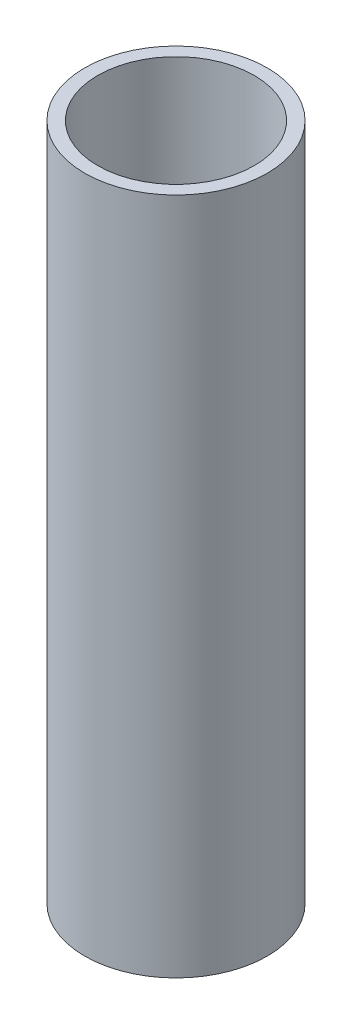
ISO-10303-21;
HEADER;
FILE_DESCRIPTION(('STEP AP214'),'2;1');
FILE_NAME('part.step','',(''),(''),'','','');
FILE_SCHEMA(('AUTOMOTIVE_DESIGN { 1 0 10303 214 1 1 1 1 }'));
ENDSEC;
DATA;
#1=APPLICATION_CONTEXT('core data for automotive mechanical design processes');
#2=APPLICATION_PROTOCOL_DEFINITION('international standard','automotive_design',2000,#1);
#3=PRODUCT_CONTEXT('',#1,'mechanical');
#4=PRODUCT('Part','Part','',(#3));
#5=PRODUCT_RELATED_PRODUCT_CATEGORY('part','',(#4));
#6=PRODUCT_DEFINITION_FORMATION('','',#4);
#7=PRODUCT_DEFINITION_CONTEXT('part definition',#1,'design');
#8=PRODUCT_DEFINITION('design','',#6,#7);
#9=PRODUCT_DEFINITION_SHAPE('','',#8);
#10=(LENGTH_UNIT() NAMED_UNIT(*) SI_UNIT(.MILLI.,.METRE.));
#11=(NAMED_UNIT(*) PLANE_ANGLE_UNIT() SI_UNIT($,.RADIAN.));
#12=(NAMED_UNIT(*) SI_UNIT($,.STERADIAN.) SOLID_ANGLE_UNIT());
#13=UNCERTAINTY_MEASURE_WITH_UNIT(LENGTH_MEASURE(1.E-05),#10,'distance_accuracy_value','');
#14=(GEOMETRIC_REPRESENTATION_CONTEXT(3) GLOBAL_UNCERTAINTY_ASSIGNED_CONTEXT((#13)) GLOBAL_UNIT_ASSIGNED_CONTEXT((#10,
#11,#12)) REPRESENTATION_CONTEXT('',''));
#15=CARTESIAN_POINT('',(0.,0.,0.));
#16=DIRECTION('',(0.,0.,1.));
#17=DIRECTION('',(1.,0.,0.));
#18=AXIS2_PLACEMENT_3D('',#15,#16,#17);
#19=CARTESIAN_POINT('',(0.,330.2,0.));
#20=DIRECTION('',(0.,1.,0.));
#21=DIRECTION('',(0.,0.,1.));
#22=AXIS2_PLACEMENT_3D('',#19,#20,#21);
#23=PLANE('',#22);
#24=CARTESIAN_POINT('',(0.,330.2,0.));
#25=DIRECTION('',(0.,1.,0.));
#26=DIRECTION('',(0.,0.,1.));
#27=AXIS2_PLACEMENT_3D('',#24,#25,#26);
#28=CIRCLE('',#27,44.45);
#29=CARTESIAN_POINT('',(0.,330.2,44.45));
#30=VERTEX_POINT('',#29);
#31=EDGE_CURVE('E10',#30,#30,#28,.T.);
#32=ORIENTED_EDGE('',*,*,#31,.T.);
#33=EDGE_LOOP('',(#32));
#34=FACE_BOUND('',#33,.T.);
#35=CARTESIAN_POINT('',(0.,330.2,0.));
#36=DIRECTION('',(0.,1.,0.));
#37=DIRECTION('',(0.,0.,1.));
#38=AXIS2_PLACEMENT_3D('',#35,#36,#37);
#39=CIRCLE('',#38,38.1);
#40=CARTESIAN_POINT('',(0.,330.2,38.1));
#41=VERTEX_POINT('',#40);
#42=EDGE_CURVE('E41',#41,#41,#39,.T.);
#43=ORIENTED_EDGE('',*,*,#42,.F.);
#44=EDGE_LOOP('',(#43));
#45=FACE_BOUND('',#44,.T.);
#46=ADVANCED_FACE('F30',(#34,#45),#23,.T.);
#47=CARTESIAN_POINT('',(0.,0.,0.));
#48=DIRECTION('',(0.,1.,0.));
#49=DIRECTION('',(0.,0.,1.));
#50=AXIS2_PLACEMENT_3D('',#47,#48,#49);
#51=PLANE('',#50);
#52=CARTESIAN_POINT('',(0.,0.,0.));
#53=DIRECTION('',(0.,1.,0.));
#54=DIRECTION('',(0.,0.,1.));
#55=AXIS2_PLACEMENT_3D('',#52,#53,#54);
#56=CIRCLE('',#55,44.45);
#57=CARTESIAN_POINT('',(0.,0.,44.45));
#58=VERTEX_POINT('',#57);
#59=EDGE_CURVE('E34',#58,#58,#56,.T.);
#60=ORIENTED_EDGE('',*,*,#59,.F.);
#61=EDGE_LOOP('',(#60));
#62=FACE_BOUND('',#61,.T.);
#63=CARTESIAN_POINT('',(0.,0.,0.));
#64=DIRECTION('',(0.,1.,0.));
#65=DIRECTION('',(0.,0.,1.));
#66=AXIS2_PLACEMENT_3D('',#63,#64,#65);
#67=CIRCLE('',#66,38.1);
#68=CARTESIAN_POINT('',(0.,0.,38.1));
#69=VERTEX_POINT('',#68);
#70=EDGE_CURVE('E43',#69,#69,#67,.T.);
#71=ORIENTED_EDGE('',*,*,#70,.T.);
#72=EDGE_LOOP('',(#71));
#73=FACE_BOUND('',#72,.T.);
#74=ADVANCED_FACE('F53',(#62,#73),#51,.F.);
#75=CARTESIAN_POINT('',(0.,330.2,0.));
#76=DIRECTION('',(0.,-1.,0.));
#77=DIRECTION('',(0.,0.,-1.));
#78=AXIS2_PLACEMENT_3D('',#75,#76,#77);
#79=CYLINDRICAL_SURFACE('',#78,44.45);
#80=ORIENTED_EDGE('',*,*,#31,.F.);
#81=EDGE_LOOP('',(#80));
#82=FACE_BOUND('',#81,.T.);
#83=ORIENTED_EDGE('',*,*,#59,.T.);
#84=EDGE_LOOP('',(#83));
#85=FACE_BOUND('',#84,.T.);
#86=ADVANCED_FACE('F32',(#82,#85),#79,.T.);
#87=CARTESIAN_POINT('',(0.,330.2,0.));
#88=DIRECTION('',(0.,-1.,0.));
#89=DIRECTION('',(0.,0.,-1.));
#90=AXIS2_PLACEMENT_3D('',#87,#88,#89);
#91=CYLINDRICAL_SURFACE('',#90,38.1);
#92=ORIENTED_EDGE('',*,*,#42,.T.);
#93=EDGE_LOOP('',(#92));
#94=FACE_BOUND('',#93,.T.);
#95=ORIENTED_EDGE('',*,*,#70,.F.);
#96=EDGE_LOOP('',(#95));
#97=FACE_BOUND('',#96,.T.);
#98=ADVANCED_FACE('F49',(#94,#97),#91,.F.);
#99=CLOSED_SHELL('',(#46,#74,#86,#98));
#100=MANIFOLD_SOLID_BREP('B2',#99);
#101=ADVANCED_BREP_SHAPE_REPRESENTATION('',(#18,#100),#14);
#102=SHAPE_DEFINITION_REPRESENTATION(#9,#101);
ENDSEC;
END-ISO-10303-21;
